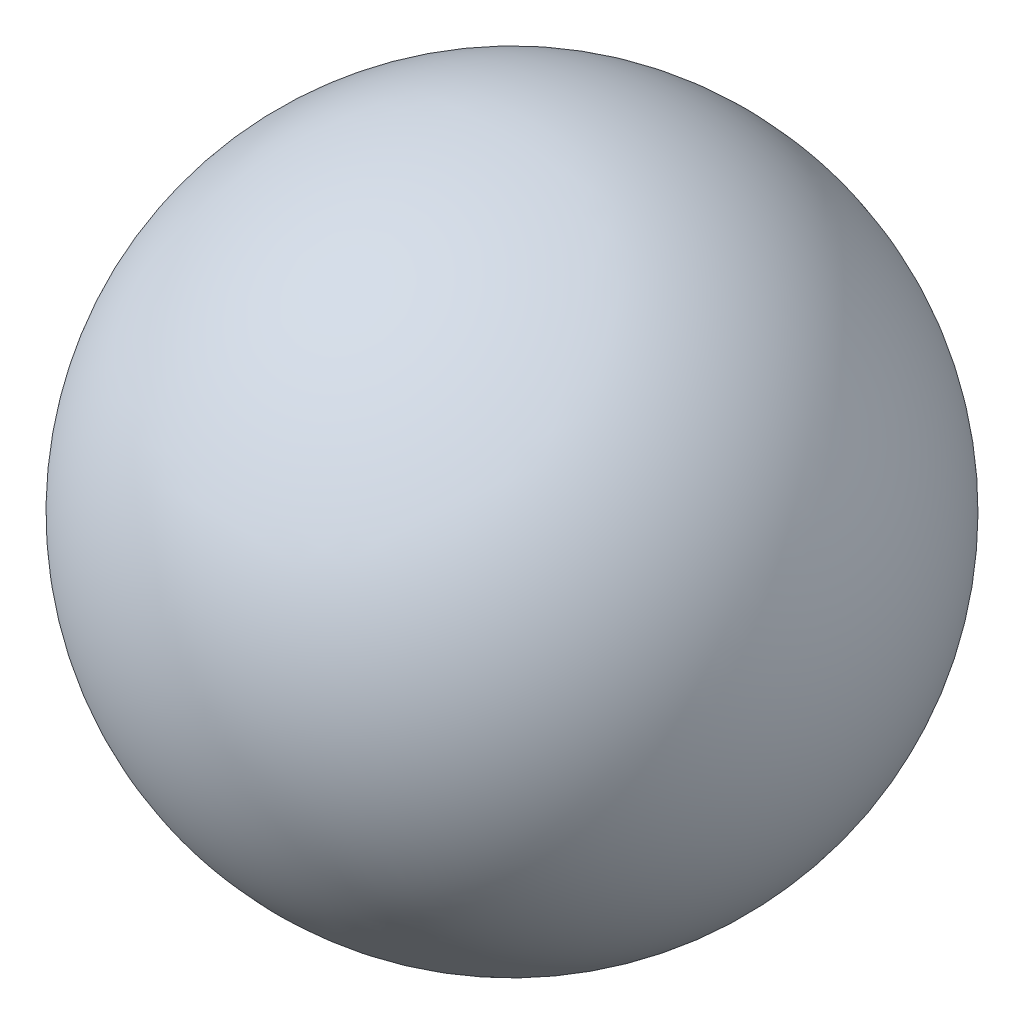
ISO-10303-21;
HEADER;
FILE_DESCRIPTION(('STEP AP214'),'2;1');
FILE_NAME('part.step','',(''),(''),'','','');
FILE_SCHEMA(('AUTOMOTIVE_DESIGN { 1 0 10303 214 1 1 1 1 }'));
ENDSEC;
DATA;
#1=APPLICATION_CONTEXT('core data for automotive mechanical design processes');
#2=APPLICATION_PROTOCOL_DEFINITION('international standard','automotive_design',2000,#1);
#3=PRODUCT_CONTEXT('',#1,'mechanical');
#4=PRODUCT('Part','Part','',(#3));
#5=PRODUCT_RELATED_PRODUCT_CATEGORY('part','',(#4));
#6=PRODUCT_DEFINITION_FORMATION('','',#4);
#7=PRODUCT_DEFINITION_CONTEXT('part definition',#1,'design');
#8=PRODUCT_DEFINITION('design','',#6,#7);
#9=PRODUCT_DEFINITION_SHAPE('','',#8);
#10=(LENGTH_UNIT() NAMED_UNIT(*) SI_UNIT(.MILLI.,.METRE.));
#11=(NAMED_UNIT(*) PLANE_ANGLE_UNIT() SI_UNIT($,.RADIAN.));
#12=(NAMED_UNIT(*) SI_UNIT($,.STERADIAN.) SOLID_ANGLE_UNIT());
#13=UNCERTAINTY_MEASURE_WITH_UNIT(LENGTH_MEASURE(1.E-05),#10,'distance_accuracy_value','');
#14=(GEOMETRIC_REPRESENTATION_CONTEXT(3) GLOBAL_UNCERTAINTY_ASSIGNED_CONTEXT((#13)) GLOBAL_UNIT_ASSIGNED_CONTEXT((#10,
#11,#12)) REPRESENTATION_CONTEXT('',''));
#15=CARTESIAN_POINT('',(0.,0.,0.));
#16=DIRECTION('',(0.,0.,1.));
#17=DIRECTION('',(1.,0.,0.));
#18=AXIS2_PLACEMENT_3D('',#15,#16,#17);
#19=CARTESIAN_POINT('',(67.76,-28.1821303124919,63.3627910314857));
#20=DIRECTION('',(0.,-0.406389996935606,0.91369971565645));
#21=DIRECTION('',(0.173648177666934,-0.899818563903522,-0.400216019728792));
#22=AXIS2_PLACEMENT_3D('',#19,#20,#21);
#23=SPHERICAL_SURFACE('',#22,7.15);
#24=CARTESIAN_POINT('',(67.76,-25.2764418344023,56.8298380645421));
#25=VERTEX_POINT('',#24);
#26=VERTEX_LOOP('',#25);
#27=FACE_BOUND('',#26,.T.);
#28=CARTESIAN_POINT('',(67.76,-31.0878187905815,69.8957439984293));
#29=VERTEX_POINT('',#28);
#30=VERTEX_LOOP('',#29);
#31=FACE_BOUND('',#30,.T.);
#32=ADVANCED_FACE('F16',(#27,#31),#23,.T.);
#33=CLOSED_SHELL('',(#32));
#34=MANIFOLD_SOLID_BREP('B1',#33);
#35=ADVANCED_BREP_SHAPE_REPRESENTATION('',(#18,#34),#14);
#36=SHAPE_DEFINITION_REPRESENTATION(#9,#35);
ENDSEC;
END-ISO-10303-21;
